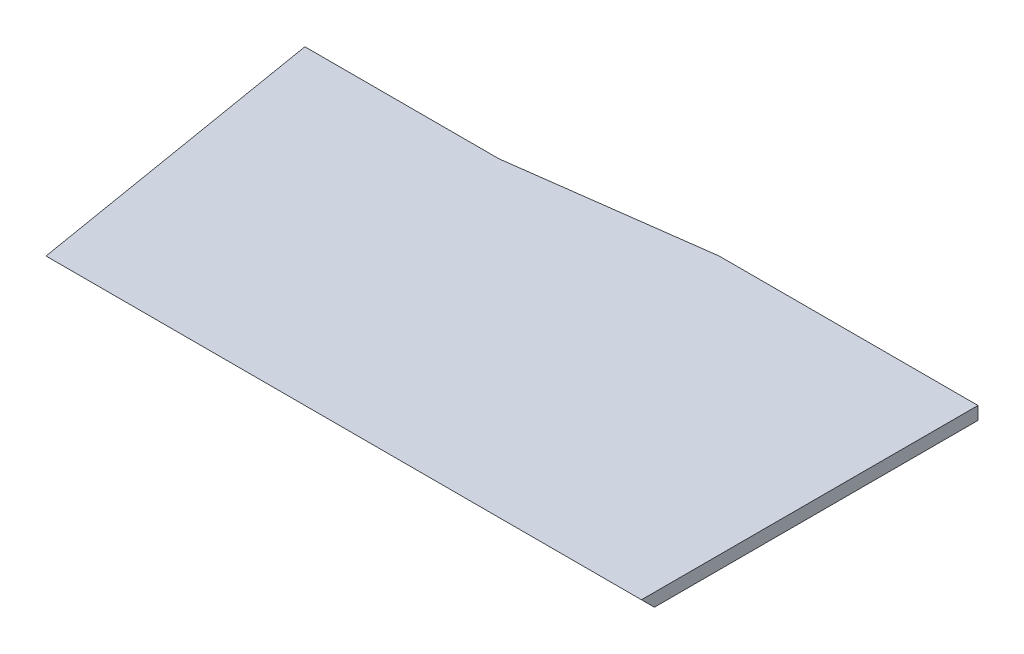
ISO-10303-21;
HEADER;
FILE_DESCRIPTION(('STEP AP214'),'2;1');
FILE_NAME('part.step','',(''),(''),'','','');
FILE_SCHEMA(('AUTOMOTIVE_DESIGN { 1 0 10303 214 1 1 1 1 }'));
ENDSEC;
DATA;
#1=APPLICATION_CONTEXT('core data for automotive mechanical design processes');
#2=APPLICATION_PROTOCOL_DEFINITION('international standard','automotive_design',2000,#1);
#3=PRODUCT_CONTEXT('',#1,'mechanical');
#4=PRODUCT('Part','Part','',(#3));
#5=PRODUCT_RELATED_PRODUCT_CATEGORY('part','',(#4));
#6=PRODUCT_DEFINITION_FORMATION('','',#4);
#7=PRODUCT_DEFINITION_CONTEXT('part definition',#1,'design');
#8=PRODUCT_DEFINITION('design','',#6,#7);
#9=PRODUCT_DEFINITION_SHAPE('','',#8);
#10=(LENGTH_UNIT() NAMED_UNIT(*) SI_UNIT(.MILLI.,.METRE.));
#11=(NAMED_UNIT(*) PLANE_ANGLE_UNIT() SI_UNIT($,.RADIAN.));
#12=(NAMED_UNIT(*) SI_UNIT($,.STERADIAN.) SOLID_ANGLE_UNIT());
#13=UNCERTAINTY_MEASURE_WITH_UNIT(LENGTH_MEASURE(1.E-05),#10,'distance_accuracy_value','');
#14=(GEOMETRIC_REPRESENTATION_CONTEXT(3) GLOBAL_UNCERTAINTY_ASSIGNED_CONTEXT((#13)) GLOBAL_UNIT_ASSIGNED_CONTEXT((#10,
#11,#12)) REPRESENTATION_CONTEXT('',''));
#15=CARTESIAN_POINT('',(0.,0.,0.));
#16=DIRECTION('',(0.,0.,1.));
#17=DIRECTION('',(1.,0.,0.));
#18=AXIS2_PLACEMENT_3D('',#15,#16,#17);
#19=CARTESIAN_POINT('',(0.,2.,-2.));
#20=DIRECTION('',(0.,0.,1.));
#21=DIRECTION('',(1.,0.,0.));
#22=AXIS2_PLACEMENT_3D('',#19,#20,#21);
#23=PLANE('',#22);
#24=DIRECTION('',(-1.,0.,0.));
#25=VECTOR('',#24,1.);
#26=CARTESIAN_POINT('',(0.,0.,-2.));
#27=LINE('',#26,#25);
#28=CARTESIAN_POINT('',(0.,0.,-2.));
#29=VERTEX_POINT('',#28);
#30=CARTESIAN_POINT('',(-40.,0.,-2.));
#31=VERTEX_POINT('',#30);
#32=EDGE_CURVE('E129',#29,#31,#27,.T.);
#33=ORIENTED_EDGE('',*,*,#32,.T.);
#34=DIRECTION('',(0.,-1.,0.));
#35=VECTOR('',#34,1.);
#36=CARTESIAN_POINT('',(-40.,2.,-2.));
#37=LINE('',#36,#35);
#38=CARTESIAN_POINT('',(-40.,2.,-2.));
#39=VERTEX_POINT('',#38);
#40=EDGE_CURVE('E97',#39,#31,#37,.T.);
#41=ORIENTED_EDGE('',*,*,#40,.F.);
#42=DIRECTION('',(-1.,0.,0.));
#43=VECTOR('',#42,1.);
#44=CARTESIAN_POINT('',(0.,2.,-2.));
#45=LINE('',#44,#43);
#46=CARTESIAN_POINT('',(0.,2.,-2.));
#47=VERTEX_POINT('',#46);
#48=EDGE_CURVE('E92',#47,#39,#45,.T.);
#49=ORIENTED_EDGE('',*,*,#48,.F.);
#50=DIRECTION('',(0.,-1.,0.));
#51=VECTOR('',#50,1.);
#52=CARTESIAN_POINT('',(0.,2.,-2.));
#53=LINE('',#52,#51);
#54=EDGE_CURVE('E95',#47,#29,#53,.T.);
#55=ORIENTED_EDGE('',*,*,#54,.T.);
#56=EDGE_LOOP('',(#33,#41,#49,#55));
#57=FACE_BOUND('',#56,.T.);
#58=ADVANCED_FACE('F39',(#57),#23,.F.);
#59=CARTESIAN_POINT('',(-40.,2.,-2.));
#60=DIRECTION('',(0.132163720091018,0.,0.991227900682635));
#61=DIRECTION('',(0.991227900682635,0.,-0.132163720091018));
#62=AXIS2_PLACEMENT_3D('',#59,#60,#61);
#63=PLANE('',#62);
#64=DIRECTION('',(-0.991227900682635,0.,0.132163720091018));
#65=VECTOR('',#64,1.);
#66=CARTESIAN_POINT('',(-40.,0.,-2.));
#67=LINE('',#66,#65);
#68=CARTESIAN_POINT('',(-70.,0.,2.));
#69=VERTEX_POINT('',#68);
#70=EDGE_CURVE('E127',#31,#69,#67,.T.);
#71=ORIENTED_EDGE('',*,*,#70,.T.);
#72=DIRECTION('',(0.,-1.,0.));
#73=VECTOR('',#72,1.);
#74=CARTESIAN_POINT('',(-70.,2.,2.));
#75=LINE('',#74,#73);
#76=CARTESIAN_POINT('',(-70.,2.,2.));
#77=VERTEX_POINT('',#76);
#78=EDGE_CURVE('E114',#77,#69,#75,.T.);
#79=ORIENTED_EDGE('',*,*,#78,.F.);
#80=DIRECTION('',(-0.991227900682635,0.,0.132163720091018));
#81=VECTOR('',#80,1.);
#82=CARTESIAN_POINT('',(-40.,2.,-2.));
#83=LINE('',#82,#81);
#84=EDGE_CURVE('E100',#39,#77,#83,.T.);
#85=ORIENTED_EDGE('',*,*,#84,.F.);
#86=ORIENTED_EDGE('',*,*,#40,.T.);
#87=EDGE_LOOP('',(#71,#79,#85,#86));
#88=FACE_BOUND('',#87,.T.);
#89=ADVANCED_FACE('F140',(#88),#63,.F.);
#90=CARTESIAN_POINT('',(-70.,2.,2.));
#91=DIRECTION('',(0.,0.,1.));
#92=DIRECTION('',(1.,0.,0.));
#93=AXIS2_PLACEMENT_3D('',#90,#91,#92);
#94=PLANE('',#93);
#95=DIRECTION('',(-1.,0.,0.));
#96=VECTOR('',#95,1.);
#97=CARTESIAN_POINT('',(-70.,0.,2.));
#98=LINE('',#97,#96);
#99=CARTESIAN_POINT('',(-100.,0.,2.));
#100=VERTEX_POINT('',#99);
#101=EDGE_CURVE('E125',#69,#100,#98,.T.);
#102=ORIENTED_EDGE('',*,*,#101,.T.);
#103=DIRECTION('',(0.,-1.,0.));
#104=VECTOR('',#103,1.);
#105=CARTESIAN_POINT('',(-100.,2.,2.));
#106=LINE('',#105,#104);
#107=CARTESIAN_POINT('',(-100.,2.,2.));
#108=VERTEX_POINT('',#107);
#109=EDGE_CURVE('E119',#108,#100,#106,.T.);
#110=ORIENTED_EDGE('',*,*,#109,.F.);
#111=DIRECTION('',(-1.,0.,0.));
#112=VECTOR('',#111,1.);
#113=CARTESIAN_POINT('',(-70.,2.,2.));
#114=LINE('',#113,#112);
#115=EDGE_CURVE('E134',#77,#108,#114,.T.);
#116=ORIENTED_EDGE('',*,*,#115,.F.);
#117=ORIENTED_EDGE('',*,*,#78,.T.);
#118=EDGE_LOOP('',(#102,#110,#116,#117));
#119=FACE_BOUND('',#118,.T.);
#120=ADVANCED_FACE('F144',(#119),#94,.F.);
#121=CARTESIAN_POINT('',(-100.,2.,2.));
#122=DIRECTION('',(0.986393923832144,0.,-0.164398987305357));
#123=DIRECTION('',(-0.164398987305357,0.,-0.986393923832144));
#124=AXIS2_PLACEMENT_3D('',#121,#122,#123);
#125=PLANE('',#124);
#126=DIRECTION('',(0.164398987305357,0.,0.986393923832144));
#127=VECTOR('',#126,1.);
#128=CARTESIAN_POINT('',(-100.,0.,2.));
#129=LINE('',#128,#127);
#130=CARTESIAN_POINT('',(-92.3333333333333,0.,48.));
#131=VERTEX_POINT('',#130);
#132=EDGE_CURVE('E123',#100,#131,#129,.T.);
#133=ORIENTED_EDGE('',*,*,#132,.T.);
#134=DIRECTION('',(-0.117041147196131,-0.702246883176781,-0.702246883176786));
#135=VECTOR('',#134,1.);
#136=CARTESIAN_POINT('',(-92.,2.,50.));
#137=LINE('',#136,#135);
#138=CARTESIAN_POINT('',(-92.,2.,50.));
#139=VERTEX_POINT('',#138);
#140=EDGE_CURVE('E11',#131,#139,#137,.F.);
#141=ORIENTED_EDGE('',*,*,#140,.T.);
#142=DIRECTION('',(0.164398987305357,0.,0.986393923832144));
#143=VECTOR('',#142,1.);
#144=CARTESIAN_POINT('',(-100.,2.,2.));
#145=LINE('',#144,#143);
#146=EDGE_CURVE('E132',#108,#139,#145,.T.);
#147=ORIENTED_EDGE('',*,*,#146,.F.);
#148=ORIENTED_EDGE('',*,*,#109,.T.);
#149=EDGE_LOOP('',(#133,#141,#147,#148));
#150=FACE_BOUND('',#149,.T.);
#151=ADVANCED_FACE('F147',(#150),#125,.F.);
#152=CARTESIAN_POINT('',(0.,2.,50.));
#153=DIRECTION('',(-1.,0.,0.));
#154=DIRECTION('',(0.,0.,1.));
#155=AXIS2_PLACEMENT_3D('',#152,#153,#154);
#156=PLANE('',#155);
#157=DIRECTION('',(0.,0.,-1.));
#158=VECTOR('',#157,1.);
#159=CARTESIAN_POINT('',(0.,2.,0.));
#160=LINE('',#159,#158);
#161=CARTESIAN_POINT('',(0.,2.,50.));
#162=VERTEX_POINT('',#161);
#163=EDGE_CURVE('E101',#162,#47,#160,.T.);
#164=ORIENTED_EDGE('',*,*,#163,.F.);
#165=DIRECTION('',(0.,0.707106781186545,0.70710678118655));
#166=VECTOR('',#165,1.);
#167=CARTESIAN_POINT('',(0.,1.99999999999999,50.));
#168=LINE('',#167,#166);
#169=CARTESIAN_POINT('',(0.,0.,48.));
#170=VERTEX_POINT('',#169);
#171=EDGE_CURVE('E62',#162,#170,#168,.F.);
#172=ORIENTED_EDGE('',*,*,#171,.T.);
#173=DIRECTION('',(0.,0.,-1.));
#174=VECTOR('',#173,1.);
#175=CARTESIAN_POINT('',(0.,0.,50.));
#176=LINE('',#175,#174);
#177=EDGE_CURVE('E108',#170,#29,#176,.T.);
#178=ORIENTED_EDGE('',*,*,#177,.T.);
#179=ORIENTED_EDGE('',*,*,#54,.F.);
#180=EDGE_LOOP('',(#164,#172,#178,#179));
#181=FACE_BOUND('',#180,.T.);
#182=ADVANCED_FACE('F110',(#181),#156,.F.);
#183=CARTESIAN_POINT('',(0.,2.,0.));
#184=DIRECTION('',(0.,1.,0.));
#185=DIRECTION('',(0.,0.,1.));
#186=AXIS2_PLACEMENT_3D('',#183,#184,#185);
#187=PLANE('',#186);
#188=ORIENTED_EDGE('',*,*,#163,.T.);
#189=ORIENTED_EDGE('',*,*,#48,.T.);
#190=ORIENTED_EDGE('',*,*,#84,.T.);
#191=ORIENTED_EDGE('',*,*,#115,.T.);
#192=ORIENTED_EDGE('',*,*,#146,.T.);
#193=DIRECTION('',(1.,0.,0.));
#194=VECTOR('',#193,1.);
#195=CARTESIAN_POINT('',(-92.,2.,50.));
#196=LINE('',#195,#194);
#197=EDGE_CURVE('E107',#139,#162,#196,.T.);
#198=ORIENTED_EDGE('',*,*,#197,.T.);
#199=EDGE_LOOP('',(#188,#189,#190,#191,#192,#198));
#200=FACE_BOUND('',#199,.T.);
#201=ADVANCED_FACE('F104',(#200),#187,.T.);
#202=CARTESIAN_POINT('',(0.,0.,0.));
#203=DIRECTION('',(0.,1.,0.));
#204=DIRECTION('',(0.,0.,1.));
#205=AXIS2_PLACEMENT_3D('',#202,#203,#204);
#206=PLANE('',#205);
#207=ORIENTED_EDGE('',*,*,#177,.F.);
#208=DIRECTION('',(-1.,0.,0.));
#209=VECTOR('',#208,1.);
#210=CARTESIAN_POINT('',(0.,0.,48.));
#211=LINE('',#210,#209);
#212=EDGE_CURVE('E48',#170,#131,#211,.T.);
#213=ORIENTED_EDGE('',*,*,#212,.T.);
#214=ORIENTED_EDGE('',*,*,#132,.F.);
#215=ORIENTED_EDGE('',*,*,#101,.F.);
#216=ORIENTED_EDGE('',*,*,#70,.F.);
#217=ORIENTED_EDGE('',*,*,#32,.F.);
#218=EDGE_LOOP('',(#207,#213,#214,#215,#216,#217));
#219=FACE_BOUND('',#218,.T.);
#220=ADVANCED_FACE('F151',(#219),#206,.F.);
#221=CARTESIAN_POINT('',(-92.,2.,50.));
#222=DIRECTION('',(0.,0.70710678118655,-0.707106781186545));
#223=DIRECTION('',(1.,0.,0.));
#224=AXIS2_PLACEMENT_3D('',#221,#222,#223);
#225=PLANE('',#224);
#226=ORIENTED_EDGE('',*,*,#140,.F.);
#227=ORIENTED_EDGE('',*,*,#212,.F.);
#228=ORIENTED_EDGE('',*,*,#171,.F.);
#229=ORIENTED_EDGE('',*,*,#197,.F.);
#230=EDGE_LOOP('',(#226,#227,#228,#229));
#231=FACE_BOUND('',#230,.T.);
#232=ADVANCED_FACE('F42',(#231),#225,.F.);
#233=CLOSED_SHELL('',(#58,#89,#120,#151,#182,#201,#220,#232));
#234=MANIFOLD_SOLID_BREP('B2',#233);
#235=ADVANCED_BREP_SHAPE_REPRESENTATION('',(#18,#234),#14);
#236=SHAPE_DEFINITION_REPRESENTATION(#9,#235);
ENDSEC;
END-ISO-10303-21;
